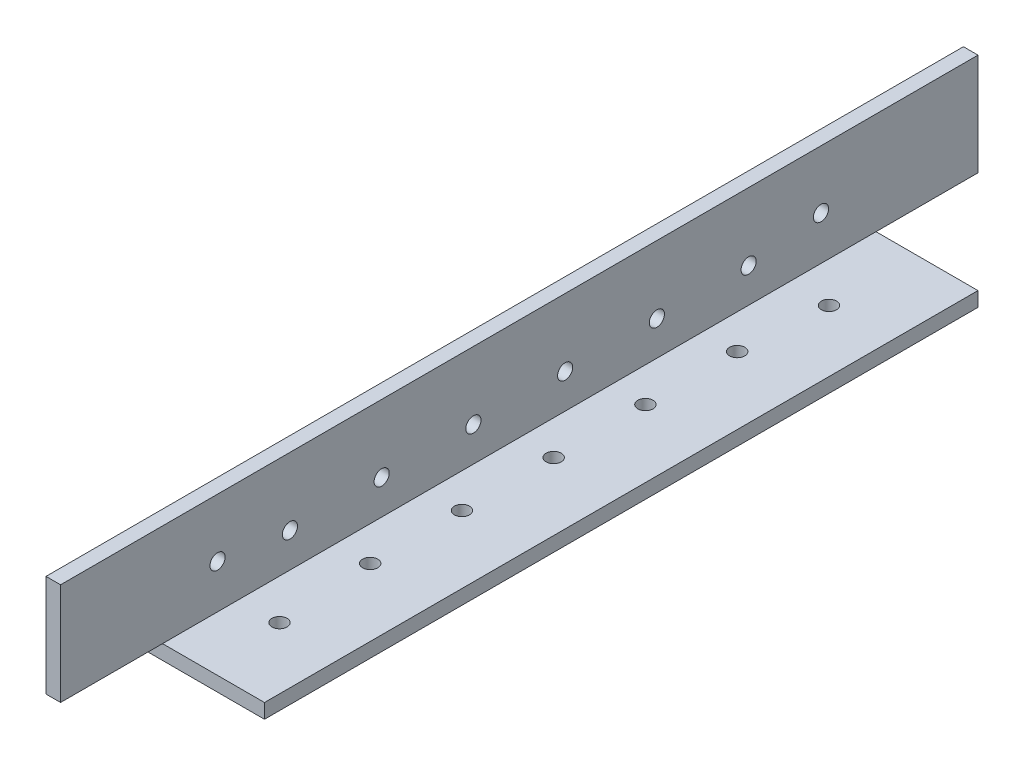
ISO-10303-21;
HEADER;
FILE_DESCRIPTION(('STEP AP214'),'2;1');
FILE_NAME('part.step','',(''),(''),'','','');
FILE_SCHEMA(('AUTOMOTIVE_DESIGN { 1 0 10303 214 1 1 1 1 }'));
ENDSEC;
DATA;
#1=APPLICATION_CONTEXT('core data for automotive mechanical design processes');
#2=APPLICATION_PROTOCOL_DEFINITION('international standard','automotive_design',2000,#1);
#3=PRODUCT_CONTEXT('',#1,'mechanical');
#4=PRODUCT('Part','Part','',(#3));
#5=PRODUCT_RELATED_PRODUCT_CATEGORY('part','',(#4));
#6=PRODUCT_DEFINITION_FORMATION('','',#4);
#7=PRODUCT_DEFINITION_CONTEXT('part definition',#1,'design');
#8=PRODUCT_DEFINITION('design','',#6,#7);
#9=PRODUCT_DEFINITION_SHAPE('','',#8);
#10=(LENGTH_UNIT() NAMED_UNIT(*) SI_UNIT(.MILLI.,.METRE.));
#11=(NAMED_UNIT(*) PLANE_ANGLE_UNIT() SI_UNIT($,.RADIAN.));
#12=(NAMED_UNIT(*) SI_UNIT($,.STERADIAN.) SOLID_ANGLE_UNIT());
#13=UNCERTAINTY_MEASURE_WITH_UNIT(LENGTH_MEASURE(1.E-05),#10,'distance_accuracy_value','');
#14=(GEOMETRIC_REPRESENTATION_CONTEXT(3) GLOBAL_UNCERTAINTY_ASSIGNED_CONTEXT((#13)) GLOBAL_UNIT_ASSIGNED_CONTEXT((#10,
#11,#12)) REPRESENTATION_CONTEXT('',''));
#15=CARTESIAN_POINT('',(0.,0.,0.));
#16=DIRECTION('',(0.,0.,1.));
#17=DIRECTION('',(1.,0.,0.));
#18=AXIS2_PLACEMENT_3D('',#15,#16,#17);
#19=CARTESIAN_POINT('',(0.,0.,1219.2));
#20=DIRECTION('',(0.,0.,1.));
#21=DIRECTION('',(1.,0.,0.));
#22=AXIS2_PLACEMENT_3D('',#19,#20,#21);
#23=PLANE('',#22);
#24=DIRECTION('',(1.,0.,0.));
#25=VECTOR('',#24,1.);
#26=CARTESIAN_POINT('',(25.4,3.175,1219.2));
#27=LINE('',#26,#25);
#28=CARTESIAN_POINT('',(0.,3.175,1219.2));
#29=VERTEX_POINT('',#28);
#30=CARTESIAN_POINT('',(3.175,3.175,1219.2));
#31=VERTEX_POINT('',#30);
#32=EDGE_CURVE('E228',#29,#31,#27,.T.);
#33=ORIENTED_EDGE('',*,*,#32,.T.);
#34=DIRECTION('',(0.,1.,0.));
#35=VECTOR('',#34,1.);
#36=CARTESIAN_POINT('',(3.175,3.175,1219.2));
#37=LINE('',#36,#35);
#38=CARTESIAN_POINT('',(3.175,25.4,1219.2));
#39=VERTEX_POINT('',#38);
#40=EDGE_CURVE('E59',#31,#39,#37,.T.);
#41=ORIENTED_EDGE('',*,*,#40,.T.);
#42=DIRECTION('',(-1.,0.,0.));
#43=VECTOR('',#42,1.);
#44=CARTESIAN_POINT('',(3.175,25.4,1219.2));
#45=LINE('',#44,#43);
#46=CARTESIAN_POINT('',(0.,25.4,1219.2));
#47=VERTEX_POINT('',#46);
#48=EDGE_CURVE('E254',#39,#47,#45,.T.);
#49=ORIENTED_EDGE('',*,*,#48,.T.);
#50=DIRECTION('',(0.,-1.,0.));
#51=VECTOR('',#50,1.);
#52=CARTESIAN_POINT('',(0.,25.4,1219.2));
#53=LINE('',#52,#51);
#54=EDGE_CURVE('E256',#47,#29,#53,.T.);
#55=ORIENTED_EDGE('',*,*,#54,.T.);
#56=EDGE_LOOP('',(#33,#41,#49,#55));
#57=FACE_BOUND('',#56,.T.);
#58=ADVANCED_FACE('F43',(#57),#23,.T.);
#59=CARTESIAN_POINT('',(60.,25.4,1019.2));
#60=DIRECTION('',(0.,0.,1.));
#61=DIRECTION('',(1.,0.,0.));
#62=AXIS2_PLACEMENT_3D('',#59,#60,#61);
#63=PLANE('',#62);
#64=DIRECTION('',(0.,1.,0.));
#65=VECTOR('',#64,1.);
#66=CARTESIAN_POINT('',(3.175,3.175,1019.2));
#67=LINE('',#66,#65);
#68=CARTESIAN_POINT('',(3.175,3.175,1019.2));
#69=VERTEX_POINT('',#68);
#70=CARTESIAN_POINT('',(3.17500000000002,25.4,1019.2));
#71=VERTEX_POINT('',#70);
#72=EDGE_CURVE('E117',#69,#71,#67,.T.);
#73=ORIENTED_EDGE('',*,*,#72,.F.);
#74=DIRECTION('',(1.,0.,0.));
#75=VECTOR('',#74,1.);
#76=CARTESIAN_POINT('',(60.,3.17500000000001,1019.2));
#77=LINE('',#76,#75);
#78=CARTESIAN_POINT('',(0.,3.175,1019.2));
#79=VERTEX_POINT('',#78);
#80=EDGE_CURVE('E52',#79,#69,#77,.T.);
#81=ORIENTED_EDGE('',*,*,#80,.F.);
#82=DIRECTION('',(0.,1.,0.));
#83=VECTOR('',#82,1.);
#84=CARTESIAN_POINT('',(0.,25.4,1019.2));
#85=LINE('',#84,#83);
#86=CARTESIAN_POINT('',(0.,25.4,1019.2));
#87=VERTEX_POINT('',#86);
#88=EDGE_CURVE('E250',#79,#87,#85,.T.);
#89=ORIENTED_EDGE('',*,*,#88,.T.);
#90=DIRECTION('',(-1.,0.,0.));
#91=VECTOR('',#90,1.);
#92=CARTESIAN_POINT('',(60.,25.4,1019.2));
#93=LINE('',#92,#91);
#94=EDGE_CURVE('E122',#71,#87,#93,.T.);
#95=ORIENTED_EDGE('',*,*,#94,.F.);
#96=EDGE_LOOP('',(#73,#81,#89,#95));
#97=FACE_BOUND('',#96,.T.);
#98=ADVANCED_FACE('F119',(#97),#63,.F.);
#99=CARTESIAN_POINT('',(3.175,3.175,1219.2));
#100=DIRECTION('',(-1.,0.,0.));
#101=DIRECTION('',(0.,-1.,0.));
#102=AXIS2_PLACEMENT_3D('',#99,#100,#101);
#103=PLANE('',#102);
#104=CARTESIAN_POINT('',(3.175,12.6999999999998,1053.42570433294));
#105=DIRECTION('',(1.,0.,0.));
#106=DIRECTION('',(0.,1.,0.));
#107=AXIS2_PLACEMENT_3D('',#104,#105,#106);
#108=CIRCLE('',#107,1.64999999999982);
#109=CARTESIAN_POINT('',(3.175,14.3499999999997,1053.42570433294));
#110=VERTEX_POINT('',#109);
#111=EDGE_CURVE('E159',#110,#110,#108,.T.);
#112=ORIENTED_EDGE('',*,*,#111,.F.);
#113=EDGE_LOOP('',(#112));
#114=FACE_BOUND('',#113,.T.);
#115=CARTESIAN_POINT('',(3.175,12.7000000000007,1184.97929566706));
#116=DIRECTION('',(1.,0.,0.));
#117=DIRECTION('',(0.,1.,0.));
#118=AXIS2_PLACEMENT_3D('',#115,#116,#117);
#119=CIRCLE('',#118,1.64999999999982);
#120=CARTESIAN_POINT('',(3.175,14.3500000000006,1184.97929566706));
#121=VERTEX_POINT('',#120);
#122=EDGE_CURVE('E165',#121,#121,#119,.T.);
#123=ORIENTED_EDGE('',*,*,#122,.F.);
#124=EDGE_LOOP('',(#123));
#125=FACE_BOUND('',#124,.T.);
#126=CARTESIAN_POINT('',(3.175,10.675,1169.2));
#127=DIRECTION('',(1.,0.,0.));
#128=DIRECTION('',(0.,1.,0.));
#129=AXIS2_PLACEMENT_3D('',#126,#127,#128);
#130=CIRCLE('',#129,1.64999999999982);
#131=CARTESIAN_POINT('',(3.175,12.3249999999998,1169.2));
#132=VERTEX_POINT('',#131);
#133=EDGE_CURVE('E144',#132,#132,#130,.T.);
#134=ORIENTED_EDGE('',*,*,#133,.F.);
#135=EDGE_LOOP('',(#134));
#136=FACE_BOUND('',#135,.T.);
#137=CARTESIAN_POINT('',(3.175,10.675,1149.2));
#138=DIRECTION('',(1.,0.,0.));
#139=DIRECTION('',(0.,1.,0.));
#140=AXIS2_PLACEMENT_3D('',#137,#138,#139);
#141=CIRCLE('',#140,1.64999999999982);
#142=CARTESIAN_POINT('',(3.175,12.3249999999998,1149.2));
#143=VERTEX_POINT('',#142);
#144=EDGE_CURVE('E207',#143,#143,#141,.T.);
#145=ORIENTED_EDGE('',*,*,#144,.F.);
#146=EDGE_LOOP('',(#145));
#147=FACE_BOUND('',#146,.T.);
#148=CARTESIAN_POINT('',(3.175,10.675,1129.2));
#149=DIRECTION('',(1.,0.,0.));
#150=DIRECTION('',(0.,1.,0.));
#151=AXIS2_PLACEMENT_3D('',#148,#149,#150);
#152=CIRCLE('',#151,1.64999999999982);
#153=CARTESIAN_POINT('',(3.175,12.3249999999998,1129.2));
#154=VERTEX_POINT('',#153);
#155=EDGE_CURVE('E210',#154,#154,#152,.T.);
#156=ORIENTED_EDGE('',*,*,#155,.F.);
#157=EDGE_LOOP('',(#156));
#158=FACE_BOUND('',#157,.T.);
#159=CARTESIAN_POINT('',(3.175,10.675,1109.2));
#160=DIRECTION('',(1.,0.,0.));
#161=DIRECTION('',(0.,1.,0.));
#162=AXIS2_PLACEMENT_3D('',#159,#160,#161);
#163=CIRCLE('',#162,1.64999999999982);
#164=CARTESIAN_POINT('',(3.175,12.3249999999998,1109.2));
#165=VERTEX_POINT('',#164);
#166=EDGE_CURVE('E213',#165,#165,#163,.T.);
#167=ORIENTED_EDGE('',*,*,#166,.F.);
#168=EDGE_LOOP('',(#167));
#169=FACE_BOUND('',#168,.T.);
#170=CARTESIAN_POINT('',(3.175,10.675,1089.2));
#171=DIRECTION('',(1.,0.,0.));
#172=DIRECTION('',(0.,1.,0.));
#173=AXIS2_PLACEMENT_3D('',#170,#171,#172);
#174=CIRCLE('',#173,1.64999999999982);
#175=CARTESIAN_POINT('',(3.175,12.3249999999998,1089.2));
#176=VERTEX_POINT('',#175);
#177=EDGE_CURVE('E216',#176,#176,#174,.T.);
#178=ORIENTED_EDGE('',*,*,#177,.F.);
#179=EDGE_LOOP('',(#178));
#180=FACE_BOUND('',#179,.T.);
#181=CARTESIAN_POINT('',(3.175,10.675,1069.2));
#182=DIRECTION('',(1.,0.,0.));
#183=DIRECTION('',(0.,1.,0.));
#184=AXIS2_PLACEMENT_3D('',#181,#182,#183);
#185=CIRCLE('',#184,1.64999999999982);
#186=CARTESIAN_POINT('',(3.175,12.3249999999998,1069.2));
#187=VERTEX_POINT('',#186);
#188=EDGE_CURVE('E204',#187,#187,#185,.T.);
#189=ORIENTED_EDGE('',*,*,#188,.F.);
#190=EDGE_LOOP('',(#189));
#191=FACE_BOUND('',#190,.T.);
#192=DIRECTION('',(0.,0.,-1.));
#193=VECTOR('',#192,1.);
#194=CARTESIAN_POINT('',(3.175,25.4,1219.2));
#195=LINE('',#194,#193);
#196=EDGE_CURVE('E134',#39,#71,#195,.T.);
#197=ORIENTED_EDGE('',*,*,#196,.F.);
#198=ORIENTED_EDGE('',*,*,#40,.F.);
#199=DIRECTION('',(0.,0.,-1.));
#200=VECTOR('',#199,1.);
#201=CARTESIAN_POINT('',(3.175,3.175,1219.2));
#202=LINE('',#201,#200);
#203=CARTESIAN_POINT('',(3.175,3.175,1196.97));
#204=VERTEX_POINT('',#203);
#205=EDGE_CURVE('E11',#31,#204,#202,.T.);
#206=ORIENTED_EDGE('',*,*,#205,.T.);
#207=DIRECTION('',(0.,0.,-1.));
#208=VECTOR('',#207,1.);
#209=CARTESIAN_POINT('',(3.175,3.175,1239.2));
#210=LINE('',#209,#208);
#211=CARTESIAN_POINT('',(3.175,3.175,1041.43));
#212=VERTEX_POINT('',#211);
#213=EDGE_CURVE('E129',#204,#212,#210,.T.);
#214=ORIENTED_EDGE('',*,*,#213,.T.);
#215=EDGE_CURVE('E127',#212,#69,#210,.T.);
#216=ORIENTED_EDGE('',*,*,#215,.T.);
#217=ORIENTED_EDGE('',*,*,#72,.T.);
#218=EDGE_LOOP('',(#197,#198,#206,#214,#216,#217));
#219=FACE_BOUND('',#218,.T.);
#220=ADVANCED_FACE('F45',(#114,#125,#136,#147,#158,#169,#180,#191,#219),#103,.F.);
#221=CARTESIAN_POINT('',(3.175,25.4,1219.2));
#222=DIRECTION('',(0.,-1.,0.));
#223=DIRECTION('',(1.,0.,0.));
#224=AXIS2_PLACEMENT_3D('',#221,#222,#223);
#225=PLANE('',#224);
#226=ORIENTED_EDGE('',*,*,#196,.T.);
#227=ORIENTED_EDGE('',*,*,#94,.T.);
#228=DIRECTION('',(0.,0.,-1.));
#229=VECTOR('',#228,1.);
#230=CARTESIAN_POINT('',(0.,25.4,1219.2));
#231=LINE('',#230,#229);
#232=EDGE_CURVE('E136',#47,#87,#231,.T.);
#233=ORIENTED_EDGE('',*,*,#232,.F.);
#234=ORIENTED_EDGE('',*,*,#48,.F.);
#235=EDGE_LOOP('',(#226,#227,#233,#234));
#236=FACE_BOUND('',#235,.T.);
#237=ADVANCED_FACE('F273',(#236),#225,.F.);
#238=CARTESIAN_POINT('',(0.,25.4,1219.2));
#239=DIRECTION('',(1.,0.,0.));
#240=DIRECTION('',(0.,1.,0.));
#241=AXIS2_PLACEMENT_3D('',#238,#239,#240);
#242=PLANE('',#241);
#243=CARTESIAN_POINT('',(0.,12.6999999999998,1053.42570433294));
#244=DIRECTION('',(1.,0.,0.));
#245=DIRECTION('',(0.,1.,0.));
#246=AXIS2_PLACEMENT_3D('',#243,#244,#245);
#247=CIRCLE('',#246,1.64999999999982);
#248=CARTESIAN_POINT('',(0.,14.3499999999997,1053.42570433294));
#249=VERTEX_POINT('',#248);
#250=EDGE_CURVE('E47',#249,#249,#247,.T.);
#251=ORIENTED_EDGE('',*,*,#250,.T.);
#252=EDGE_LOOP('',(#251));
#253=FACE_BOUND('',#252,.T.);
#254=CARTESIAN_POINT('',(0.,12.7000000000007,1184.97929566706));
#255=DIRECTION('',(1.,0.,0.));
#256=DIRECTION('',(0.,1.,0.));
#257=AXIS2_PLACEMENT_3D('',#254,#255,#256);
#258=CIRCLE('',#257,1.64999999999982);
#259=CARTESIAN_POINT('',(0.,14.3500000000006,1184.97929566706));
#260=VERTEX_POINT('',#259);
#261=EDGE_CURVE('E157',#260,#260,#258,.T.);
#262=ORIENTED_EDGE('',*,*,#261,.T.);
#263=EDGE_LOOP('',(#262));
#264=FACE_BOUND('',#263,.T.);
#265=CARTESIAN_POINT('',(0.,10.675,1169.2));
#266=DIRECTION('',(1.,0.,0.));
#267=DIRECTION('',(0.,1.,0.));
#268=AXIS2_PLACEMENT_3D('',#265,#266,#267);
#269=CIRCLE('',#268,1.64999999999982);
#270=CARTESIAN_POINT('',(0.,12.3249999999998,1169.2));
#271=VERTEX_POINT('',#270);
#272=EDGE_CURVE('E131',#271,#271,#269,.T.);
#273=ORIENTED_EDGE('',*,*,#272,.T.);
#274=EDGE_LOOP('',(#273));
#275=FACE_BOUND('',#274,.T.);
#276=CARTESIAN_POINT('',(0.,10.675,1149.2));
#277=DIRECTION('',(1.,0.,0.));
#278=DIRECTION('',(0.,1.,0.));
#279=AXIS2_PLACEMENT_3D('',#276,#277,#278);
#280=CIRCLE('',#279,1.64999999999982);
#281=CARTESIAN_POINT('',(0.,12.3249999999998,1149.2));
#282=VERTEX_POINT('',#281);
#283=EDGE_CURVE('E153',#282,#282,#280,.T.);
#284=ORIENTED_EDGE('',*,*,#283,.T.);
#285=EDGE_LOOP('',(#284));
#286=FACE_BOUND('',#285,.T.);
#287=CARTESIAN_POINT('',(0.,10.675,1129.2));
#288=DIRECTION('',(1.,0.,0.));
#289=DIRECTION('',(0.,1.,0.));
#290=AXIS2_PLACEMENT_3D('',#287,#288,#289);
#291=CIRCLE('',#290,1.64999999999982);
#292=CARTESIAN_POINT('',(0.,12.3249999999998,1129.2));
#293=VERTEX_POINT('',#292);
#294=EDGE_CURVE('E150',#293,#293,#291,.T.);
#295=ORIENTED_EDGE('',*,*,#294,.T.);
#296=EDGE_LOOP('',(#295));
#297=FACE_BOUND('',#296,.T.);
#298=CARTESIAN_POINT('',(0.,10.675,1109.2));
#299=DIRECTION('',(1.,0.,0.));
#300=DIRECTION('',(0.,1.,0.));
#301=AXIS2_PLACEMENT_3D('',#298,#299,#300);
#302=CIRCLE('',#301,1.64999999999982);
#303=CARTESIAN_POINT('',(0.,12.3249999999998,1109.2));
#304=VERTEX_POINT('',#303);
#305=EDGE_CURVE('E147',#304,#304,#302,.T.);
#306=ORIENTED_EDGE('',*,*,#305,.T.);
#307=EDGE_LOOP('',(#306));
#308=FACE_BOUND('',#307,.T.);
#309=CARTESIAN_POINT('',(0.,10.675,1089.2));
#310=DIRECTION('',(1.,0.,0.));
#311=DIRECTION('',(0.,1.,0.));
#312=AXIS2_PLACEMENT_3D('',#309,#310,#311);
#313=CIRCLE('',#312,1.64999999999982);
#314=CARTESIAN_POINT('',(0.,12.3249999999998,1089.2));
#315=VERTEX_POINT('',#314);
#316=EDGE_CURVE('E143',#315,#315,#313,.T.);
#317=ORIENTED_EDGE('',*,*,#316,.T.);
#318=EDGE_LOOP('',(#317));
#319=FACE_BOUND('',#318,.T.);
#320=CARTESIAN_POINT('',(0.,10.675,1069.2));
#321=DIRECTION('',(1.,0.,0.));
#322=DIRECTION('',(0.,1.,0.));
#323=AXIS2_PLACEMENT_3D('',#320,#321,#322);
#324=CIRCLE('',#323,1.64999999999982);
#325=CARTESIAN_POINT('',(0.,12.3249999999998,1069.2));
#326=VERTEX_POINT('',#325);
#327=EDGE_CURVE('E140',#326,#326,#324,.T.);
#328=ORIENTED_EDGE('',*,*,#327,.T.);
#329=EDGE_LOOP('',(#328));
#330=FACE_BOUND('',#329,.T.);
#331=DIRECTION('',(0.,0.,-1.));
#332=VECTOR('',#331,1.);
#333=CARTESIAN_POINT('',(0.,0.,1219.2));
#334=LINE('',#333,#332);
#335=CARTESIAN_POINT('',(0.,0.,1196.97));
#336=VERTEX_POINT('',#335);
#337=CARTESIAN_POINT('',(0.,0.,1041.43));
#338=VERTEX_POINT('',#337);
#339=EDGE_CURVE('E264',#336,#338,#334,.T.);
#340=ORIENTED_EDGE('',*,*,#339,.F.);
#341=DIRECTION('',(0.,-1.,0.));
#342=VECTOR('',#341,1.);
#343=CARTESIAN_POINT('',(0.,36.9290056882142,1196.97));
#344=LINE('',#343,#342);
#345=CARTESIAN_POINT('',(0.,3.175,1196.97));
#346=VERTEX_POINT('',#345);
#347=EDGE_CURVE('E231',#346,#336,#344,.T.);
#348=ORIENTED_EDGE('',*,*,#347,.F.);
#349=DIRECTION('',(0.,0.,1.));
#350=VECTOR('',#349,1.);
#351=CARTESIAN_POINT('',(0.,3.175,1219.2));
#352=LINE('',#351,#350);
#353=EDGE_CURVE('E221',#346,#29,#352,.T.);
#354=ORIENTED_EDGE('',*,*,#353,.T.);
#355=ORIENTED_EDGE('',*,*,#54,.F.);
#356=ORIENTED_EDGE('',*,*,#232,.T.);
#357=ORIENTED_EDGE('',*,*,#88,.F.);
#358=DIRECTION('',(0.,0.,1.));
#359=VECTOR('',#358,1.);
#360=CARTESIAN_POINT('',(0.,3.175,1019.2));
#361=LINE('',#360,#359);
#362=CARTESIAN_POINT('',(0.,3.175,1041.43));
#363=VERTEX_POINT('',#362);
#364=EDGE_CURVE('E67',#79,#363,#361,.T.);
#365=ORIENTED_EDGE('',*,*,#364,.T.);
#366=DIRECTION('',(0.,-1.,0.));
#367=VECTOR('',#366,1.);
#368=CARTESIAN_POINT('',(0.,36.9290056882142,1041.43));
#369=LINE('',#368,#367);
#370=EDGE_CURVE('E240',#363,#338,#369,.T.);
#371=ORIENTED_EDGE('',*,*,#370,.T.);
#372=EDGE_LOOP('',(#340,#348,#354,#355,#356,#357,#365,#371));
#373=FACE_BOUND('',#372,.T.);
#374=ADVANCED_FACE('F270',(#253,#264,#275,#286,#297,#308,#319,#330,#373),#242,.F.);
#375=CARTESIAN_POINT('',(0.,0.,1219.2));
#376=DIRECTION('',(0.,1.,0.));
#377=DIRECTION('',(0.,0.,1.));
#378=AXIS2_PLACEMENT_3D('',#375,#376,#377);
#379=PLANE('',#378);
#380=CARTESIAN_POINT('',(11.9634000000024,0.,1180.26062285682));
#381=DIRECTION('',(0.,1.,0.));
#382=DIRECTION('',(0.,0.,1.));
#383=AXIS2_PLACEMENT_3D('',#380,#381,#382);
#384=CIRCLE('',#383,1.65000000000001);
#385=CARTESIAN_POINT('',(11.9634000000024,0.,1181.91062285682));
#386=VERTEX_POINT('',#385);
#387=EDGE_CURVE('E170',#386,#386,#384,.T.);
#388=ORIENTED_EDGE('',*,*,#387,.T.);
#389=EDGE_LOOP('',(#388));
#390=FACE_BOUND('',#389,.T.);
#391=CARTESIAN_POINT('',(11.9634000000002,0.,1060.48));
#392=DIRECTION('',(0.,1.,0.));
#393=DIRECTION('',(0.,0.,1.));
#394=AXIS2_PLACEMENT_3D('',#391,#392,#393);
#395=CIRCLE('',#394,1.65);
#396=CARTESIAN_POINT('',(11.9634000000002,0.,1062.13));
#397=VERTEX_POINT('',#396);
#398=EDGE_CURVE('E387',#397,#397,#395,.T.);
#399=ORIENTED_EDGE('',*,*,#398,.T.);
#400=EDGE_LOOP('',(#399));
#401=FACE_BOUND('',#400,.T.);
#402=CARTESIAN_POINT('',(10.675,0.,1079.2));
#403=DIRECTION('',(0.,1.,0.));
#404=DIRECTION('',(0.,0.,1.));
#405=AXIS2_PLACEMENT_3D('',#402,#403,#404);
#406=CIRCLE('',#405,1.65000000000001);
#407=CARTESIAN_POINT('',(10.675,0.,1080.85));
#408=VERTEX_POINT('',#407);
#409=EDGE_CURVE('E201',#408,#408,#406,.T.);
#410=ORIENTED_EDGE('',*,*,#409,.T.);
#411=EDGE_LOOP('',(#410));
#412=FACE_BOUND('',#411,.T.);
#413=CARTESIAN_POINT('',(10.6750000000002,0.,1099.2));
#414=DIRECTION('',(0.,1.,0.));
#415=DIRECTION('',(0.,0.,1.));
#416=AXIS2_PLACEMENT_3D('',#413,#414,#415);
#417=CIRCLE('',#416,1.65000000000001);
#418=CARTESIAN_POINT('',(10.6750000000002,0.,1100.85));
#419=VERTEX_POINT('',#418);
#420=EDGE_CURVE('E198',#419,#419,#417,.T.);
#421=ORIENTED_EDGE('',*,*,#420,.T.);
#422=EDGE_LOOP('',(#421));
#423=FACE_BOUND('',#422,.T.);
#424=CARTESIAN_POINT('',(10.6750000000004,0.,1119.2));
#425=DIRECTION('',(0.,1.,0.));
#426=DIRECTION('',(0.,0.,1.));
#427=AXIS2_PLACEMENT_3D('',#424,#425,#426);
#428=CIRCLE('',#427,1.65000000000001);
#429=CARTESIAN_POINT('',(10.6750000000004,0.,1120.85));
#430=VERTEX_POINT('',#429);
#431=EDGE_CURVE('E195',#430,#430,#428,.T.);
#432=ORIENTED_EDGE('',*,*,#431,.T.);
#433=EDGE_LOOP('',(#432));
#434=FACE_BOUND('',#433,.T.);
#435=CARTESIAN_POINT('',(10.6750000000006,0.,1139.2));
#436=DIRECTION('',(0.,1.,0.));
#437=DIRECTION('',(0.,0.,1.));
#438=AXIS2_PLACEMENT_3D('',#435,#436,#437);
#439=CIRCLE('',#438,1.65000000000001);
#440=CARTESIAN_POINT('',(10.6750000000006,0.,1140.85));
#441=VERTEX_POINT('',#440);
#442=EDGE_CURVE('E192',#441,#441,#439,.T.);
#443=ORIENTED_EDGE('',*,*,#442,.T.);
#444=EDGE_LOOP('',(#443));
#445=FACE_BOUND('',#444,.T.);
#446=CARTESIAN_POINT('',(10.6750000000008,0.,1159.2));
#447=DIRECTION('',(0.,1.,0.));
#448=DIRECTION('',(0.,0.,1.));
#449=AXIS2_PLACEMENT_3D('',#446,#447,#448);
#450=CIRCLE('',#449,1.65000000000001);
#451=CARTESIAN_POINT('',(10.6750000000008,0.,1160.85));
#452=VERTEX_POINT('',#451);
#453=EDGE_CURVE('E178',#452,#452,#450,.T.);
#454=ORIENTED_EDGE('',*,*,#453,.T.);
#455=EDGE_LOOP('',(#454));
#456=FACE_BOUND('',#455,.T.);
#457=DIRECTION('',(0.,0.,-1.));
#458=VECTOR('',#457,1.);
#459=CARTESIAN_POINT('',(25.4,0.,1219.2));
#460=LINE('',#459,#458);
#461=CARTESIAN_POINT('',(25.4,0.,1196.97));
#462=VERTEX_POINT('',#461);
#463=CARTESIAN_POINT('',(25.4,0.,1041.43));
#464=VERTEX_POINT('',#463);
#465=EDGE_CURVE('E262',#462,#464,#460,.T.);
#466=ORIENTED_EDGE('',*,*,#465,.F.);
#467=DIRECTION('',(1.,0.,0.));
#468=VECTOR('',#467,1.);
#469=CARTESIAN_POINT('',(25.4,0.,1196.97));
#470=LINE('',#469,#468);
#471=EDGE_CURVE('E229',#336,#462,#470,.T.);
#472=ORIENTED_EDGE('',*,*,#471,.F.);
#473=ORIENTED_EDGE('',*,*,#339,.T.);
#474=DIRECTION('',(-1.,0.,0.));
#475=VECTOR('',#474,1.);
#476=CARTESIAN_POINT('',(25.4,0.,1041.43));
#477=LINE('',#476,#475);
#478=EDGE_CURVE('E237',#464,#338,#477,.T.);
#479=ORIENTED_EDGE('',*,*,#478,.F.);
#480=EDGE_LOOP('',(#466,#472,#473,#479));
#481=FACE_BOUND('',#480,.T.);
#482=ADVANCED_FACE('F285',(#390,#401,#412,#423,#434,#445,#456,#481),#379,.F.);
#483=CARTESIAN_POINT('',(25.4,0.,1219.2));
#484=DIRECTION('',(-1.,0.,0.));
#485=DIRECTION('',(0.,0.,1.));
#486=AXIS2_PLACEMENT_3D('',#483,#484,#485);
#487=PLANE('',#486);
#488=DIRECTION('',(0.,0.,-1.));
#489=VECTOR('',#488,1.);
#490=CARTESIAN_POINT('',(25.4,3.175,1219.2));
#491=LINE('',#490,#489);
#492=CARTESIAN_POINT('',(25.4,3.175,1196.97));
#493=VERTEX_POINT('',#492);
#494=CARTESIAN_POINT('',(25.4,3.175,1041.43));
#495=VERTEX_POINT('',#494);
#496=EDGE_CURVE('E259',#493,#495,#491,.T.);
#497=ORIENTED_EDGE('',*,*,#496,.F.);
#498=DIRECTION('',(0.,-1.,0.));
#499=VECTOR('',#498,1.);
#500=CARTESIAN_POINT('',(25.4,36.9290056882142,1196.97));
#501=LINE('',#500,#499);
#502=EDGE_CURVE('E225',#493,#462,#501,.T.);
#503=ORIENTED_EDGE('',*,*,#502,.T.);
#504=ORIENTED_EDGE('',*,*,#465,.T.);
#505=DIRECTION('',(0.,-1.,0.));
#506=VECTOR('',#505,1.);
#507=CARTESIAN_POINT('',(25.4,36.9290056882142,1041.43));
#508=LINE('',#507,#506);
#509=EDGE_CURVE('E243',#495,#464,#508,.T.);
#510=ORIENTED_EDGE('',*,*,#509,.F.);
#511=EDGE_LOOP('',(#497,#503,#504,#510));
#512=FACE_BOUND('',#511,.T.);
#513=ADVANCED_FACE('F290',(#512),#487,.F.);
#514=CARTESIAN_POINT('',(25.4,3.175,1219.2));
#515=DIRECTION('',(0.,-1.,0.));
#516=DIRECTION('',(1.,0.,0.));
#517=AXIS2_PLACEMENT_3D('',#514,#515,#516);
#518=PLANE('',#517);
#519=CARTESIAN_POINT('',(11.9634000000024,3.175,1180.26062285682));
#520=DIRECTION('',(0.,1.,0.));
#521=DIRECTION('',(-1.,0.,0.));
#522=AXIS2_PLACEMENT_3D('',#519,#520,#521);
#523=CIRCLE('',#522,1.65000000000001);
#524=CARTESIAN_POINT('',(10.3134000000024,3.175,1180.26062285682));
#525=VERTEX_POINT('',#524);
#526=EDGE_CURVE('E383',#525,#525,#523,.T.);
#527=ORIENTED_EDGE('',*,*,#526,.F.);
#528=EDGE_LOOP('',(#527));
#529=FACE_BOUND('',#528,.T.);
#530=CARTESIAN_POINT('',(11.9634000000002,3.175,1060.48));
#531=DIRECTION('',(0.,1.,0.));
#532=DIRECTION('',(-1.,0.,0.));
#533=AXIS2_PLACEMENT_3D('',#530,#531,#532);
#534=CIRCLE('',#533,1.65);
#535=CARTESIAN_POINT('',(10.3134000000002,3.175,1060.48));
#536=VERTEX_POINT('',#535);
#537=EDGE_CURVE('E391',#536,#536,#534,.T.);
#538=ORIENTED_EDGE('',*,*,#537,.F.);
#539=EDGE_LOOP('',(#538));
#540=FACE_BOUND('',#539,.T.);
#541=CARTESIAN_POINT('',(10.675,3.175,1079.2));
#542=DIRECTION('',(0.,1.,0.));
#543=DIRECTION('',(-1.,0.,0.));
#544=AXIS2_PLACEMENT_3D('',#541,#542,#543);
#545=CIRCLE('',#544,1.65000000000001);
#546=CARTESIAN_POINT('',(9.02499999999999,3.175,1079.2));
#547=VERTEX_POINT('',#546);
#548=EDGE_CURVE('E175',#547,#547,#545,.T.);
#549=ORIENTED_EDGE('',*,*,#548,.F.);
#550=EDGE_LOOP('',(#549));
#551=FACE_BOUND('',#550,.T.);
#552=CARTESIAN_POINT('',(10.6750000000002,3.175,1099.2));
#553=DIRECTION('',(0.,1.,0.));
#554=DIRECTION('',(-1.,0.,0.));
#555=AXIS2_PLACEMENT_3D('',#552,#553,#554);
#556=CIRCLE('',#555,1.65000000000001);
#557=CARTESIAN_POINT('',(9.0250000000002,3.175,1099.2));
#558=VERTEX_POINT('',#557);
#559=EDGE_CURVE('E179',#558,#558,#556,.T.);
#560=ORIENTED_EDGE('',*,*,#559,.F.);
#561=EDGE_LOOP('',(#560));
#562=FACE_BOUND('',#561,.T.);
#563=CARTESIAN_POINT('',(10.6750000000004,3.175,1119.2));
#564=DIRECTION('',(0.,1.,0.));
#565=DIRECTION('',(-1.,0.,0.));
#566=AXIS2_PLACEMENT_3D('',#563,#564,#565);
#567=CIRCLE('',#566,1.65000000000001);
#568=CARTESIAN_POINT('',(9.02500000000041,3.175,1119.2));
#569=VERTEX_POINT('',#568);
#570=EDGE_CURVE('E182',#569,#569,#567,.T.);
#571=ORIENTED_EDGE('',*,*,#570,.F.);
#572=EDGE_LOOP('',(#571));
#573=FACE_BOUND('',#572,.T.);
#574=CARTESIAN_POINT('',(10.6750000000006,3.175,1139.2));
#575=DIRECTION('',(0.,1.,0.));
#576=DIRECTION('',(-1.,0.,0.));
#577=AXIS2_PLACEMENT_3D('',#574,#575,#576);
#578=CIRCLE('',#577,1.65000000000001);
#579=CARTESIAN_POINT('',(9.02500000000062,3.175,1139.2));
#580=VERTEX_POINT('',#579);
#581=EDGE_CURVE('E185',#580,#580,#578,.T.);
#582=ORIENTED_EDGE('',*,*,#581,.F.);
#583=EDGE_LOOP('',(#582));
#584=FACE_BOUND('',#583,.T.);
#585=CARTESIAN_POINT('',(10.6750000000008,3.175,1159.2));
#586=DIRECTION('',(0.,1.,0.));
#587=DIRECTION('',(-1.,0.,0.));
#588=AXIS2_PLACEMENT_3D('',#585,#586,#587);
#589=CIRCLE('',#588,1.65000000000001);
#590=CARTESIAN_POINT('',(9.02500000000083,3.175,1159.2));
#591=VERTEX_POINT('',#590);
#592=EDGE_CURVE('E163',#591,#591,#589,.T.);
#593=ORIENTED_EDGE('',*,*,#592,.F.);
#594=EDGE_LOOP('',(#593));
#595=FACE_BOUND('',#594,.T.);
#596=ORIENTED_EDGE('',*,*,#496,.T.);
#597=DIRECTION('',(1.,0.,0.));
#598=VECTOR('',#597,1.);
#599=CARTESIAN_POINT('',(25.4,3.175,1041.43));
#600=LINE('',#599,#598);
#601=EDGE_CURVE('E239',#212,#495,#600,.T.);
#602=ORIENTED_EDGE('',*,*,#601,.F.);
#603=ORIENTED_EDGE('',*,*,#213,.F.);
#604=DIRECTION('',(-1.,0.,0.));
#605=VECTOR('',#604,1.);
#606=CARTESIAN_POINT('',(25.4,3.175,1196.97));
#607=LINE('',#606,#605);
#608=EDGE_CURVE('E226',#493,#204,#607,.T.);
#609=ORIENTED_EDGE('',*,*,#608,.F.);
#610=EDGE_LOOP('',(#596,#602,#603,#609));
#611=FACE_BOUND('',#610,.T.);
#612=ADVANCED_FACE('F295',(#529,#540,#551,#562,#573,#584,#595,#611),#518,.F.);
#613=CARTESIAN_POINT('',(25.4,36.9290056882142,1041.43));
#614=DIRECTION('',(0.,0.,1.));
#615=DIRECTION('',(1.,0.,0.));
#616=AXIS2_PLACEMENT_3D('',#613,#614,#615);
#617=PLANE('',#616);
#618=EDGE_CURVE('E248',#363,#212,#600,.T.);
#619=ORIENTED_EDGE('',*,*,#618,.T.);
#620=ORIENTED_EDGE('',*,*,#601,.T.);
#621=ORIENTED_EDGE('',*,*,#509,.T.);
#622=ORIENTED_EDGE('',*,*,#478,.T.);
#623=ORIENTED_EDGE('',*,*,#370,.F.);
#624=EDGE_LOOP('',(#619,#620,#621,#622,#623));
#625=FACE_BOUND('',#624,.T.);
#626=ADVANCED_FACE('F292',(#625),#617,.F.);
#627=CARTESIAN_POINT('',(25.4,3.175,1219.2));
#628=DIRECTION('',(0.,-1.,0.));
#629=DIRECTION('',(1.,0.,0.));
#630=AXIS2_PLACEMENT_3D('',#627,#628,#629);
#631=PLANE('',#630);
#632=ORIENTED_EDGE('',*,*,#215,.F.);
#633=ORIENTED_EDGE('',*,*,#618,.F.);
#634=ORIENTED_EDGE('',*,*,#364,.F.);
#635=ORIENTED_EDGE('',*,*,#80,.T.);
#636=EDGE_LOOP('',(#632,#633,#634,#635));
#637=FACE_BOUND('',#636,.T.);
#638=ADVANCED_FACE('F133',(#637),#631,.T.);
#639=CARTESIAN_POINT('',(25.4,36.9290056882142,1196.97));
#640=DIRECTION('',(0.,0.,-1.));
#641=DIRECTION('',(-1.,0.,0.));
#642=AXIS2_PLACEMENT_3D('',#639,#640,#641);
#643=PLANE('',#642);
#644=ORIENTED_EDGE('',*,*,#608,.T.);
#645=EDGE_CURVE('E224',#204,#346,#607,.T.);
#646=ORIENTED_EDGE('',*,*,#645,.T.);
#647=ORIENTED_EDGE('',*,*,#347,.T.);
#648=ORIENTED_EDGE('',*,*,#471,.T.);
#649=ORIENTED_EDGE('',*,*,#502,.F.);
#650=EDGE_LOOP('',(#644,#646,#647,#648,#649));
#651=FACE_BOUND('',#650,.T.);
#652=ADVANCED_FACE('F282',(#651),#643,.F.);
#653=CARTESIAN_POINT('',(25.4,3.175,1219.2));
#654=DIRECTION('',(0.,-1.,0.));
#655=DIRECTION('',(1.,0.,0.));
#656=AXIS2_PLACEMENT_3D('',#653,#654,#655);
#657=PLANE('',#656);
#658=ORIENTED_EDGE('',*,*,#205,.F.);
#659=ORIENTED_EDGE('',*,*,#32,.F.);
#660=ORIENTED_EDGE('',*,*,#353,.F.);
#661=ORIENTED_EDGE('',*,*,#645,.F.);
#662=EDGE_LOOP('',(#658,#659,#660,#661));
#663=FACE_BOUND('',#662,.T.);
#664=ADVANCED_FACE('F277',(#663),#657,.T.);
#665=CARTESIAN_POINT('',(-16.825,10.675,1069.2));
#666=DIRECTION('',(1.,0.,0.));
#667=DIRECTION('',(0.,1.,0.));
#668=AXIS2_PLACEMENT_3D('',#665,#666,#667);
#669=CYLINDRICAL_SURFACE('',#668,1.64999999999982);
#670=ORIENTED_EDGE('',*,*,#188,.T.);
#671=EDGE_LOOP('',(#670));
#672=FACE_BOUND('',#671,.T.);
#673=ORIENTED_EDGE('',*,*,#327,.F.);
#674=EDGE_LOOP('',(#673));
#675=FACE_BOUND('',#674,.T.);
#676=ADVANCED_FACE('F322',(#672,#675),#669,.F.);
#677=CARTESIAN_POINT('',(-16.825,10.675,1089.2));
#678=DIRECTION('',(1.,0.,0.));
#679=DIRECTION('',(0.,1.,0.));
#680=AXIS2_PLACEMENT_3D('',#677,#678,#679);
#681=CYLINDRICAL_SURFACE('',#680,1.64999999999982);
#682=ORIENTED_EDGE('',*,*,#177,.T.);
#683=EDGE_LOOP('',(#682));
#684=FACE_BOUND('',#683,.T.);
#685=ORIENTED_EDGE('',*,*,#316,.F.);
#686=EDGE_LOOP('',(#685));
#687=FACE_BOUND('',#686,.T.);
#688=ADVANCED_FACE('F325',(#684,#687),#681,.F.);
#689=CARTESIAN_POINT('',(-16.825,10.675,1109.2));
#690=DIRECTION('',(1.,0.,0.));
#691=DIRECTION('',(0.,1.,0.));
#692=AXIS2_PLACEMENT_3D('',#689,#690,#691);
#693=CYLINDRICAL_SURFACE('',#692,1.64999999999982);
#694=ORIENTED_EDGE('',*,*,#166,.T.);
#695=EDGE_LOOP('',(#694));
#696=FACE_BOUND('',#695,.T.);
#697=ORIENTED_EDGE('',*,*,#305,.F.);
#698=EDGE_LOOP('',(#697));
#699=FACE_BOUND('',#698,.T.);
#700=ADVANCED_FACE('F329',(#696,#699),#693,.F.);
#701=CARTESIAN_POINT('',(-16.825,10.675,1129.2));
#702=DIRECTION('',(1.,0.,0.));
#703=DIRECTION('',(0.,1.,0.));
#704=AXIS2_PLACEMENT_3D('',#701,#702,#703);
#705=CYLINDRICAL_SURFACE('',#704,1.64999999999982);
#706=ORIENTED_EDGE('',*,*,#155,.T.);
#707=EDGE_LOOP('',(#706));
#708=FACE_BOUND('',#707,.T.);
#709=ORIENTED_EDGE('',*,*,#294,.F.);
#710=EDGE_LOOP('',(#709));
#711=FACE_BOUND('',#710,.T.);
#712=ADVANCED_FACE('F333',(#708,#711),#705,.F.);
#713=CARTESIAN_POINT('',(-16.825,10.675,1149.2));
#714=DIRECTION('',(1.,0.,0.));
#715=DIRECTION('',(0.,1.,0.));
#716=AXIS2_PLACEMENT_3D('',#713,#714,#715);
#717=CYLINDRICAL_SURFACE('',#716,1.64999999999982);
#718=ORIENTED_EDGE('',*,*,#144,.T.);
#719=EDGE_LOOP('',(#718));
#720=FACE_BOUND('',#719,.T.);
#721=ORIENTED_EDGE('',*,*,#283,.F.);
#722=EDGE_LOOP('',(#721));
#723=FACE_BOUND('',#722,.T.);
#724=ADVANCED_FACE('F337',(#720,#723),#717,.F.);
#725=CARTESIAN_POINT('',(-16.825,10.675,1169.2));
#726=DIRECTION('',(1.,0.,0.));
#727=DIRECTION('',(0.,1.,0.));
#728=AXIS2_PLACEMENT_3D('',#725,#726,#727);
#729=CYLINDRICAL_SURFACE('',#728,1.64999999999982);
#730=ORIENTED_EDGE('',*,*,#133,.T.);
#731=EDGE_LOOP('',(#730));
#732=FACE_BOUND('',#731,.T.);
#733=ORIENTED_EDGE('',*,*,#272,.F.);
#734=EDGE_LOOP('',(#733));
#735=FACE_BOUND('',#734,.T.);
#736=ADVANCED_FACE('F341',(#732,#735),#729,.F.);
#737=CARTESIAN_POINT('',(10.6750000000008,-16.825,1159.2));
#738=DIRECTION('',(0.,1.,0.));
#739=DIRECTION('',(-1.,0.,0.));
#740=AXIS2_PLACEMENT_3D('',#737,#738,#739);
#741=CYLINDRICAL_SURFACE('',#740,1.65000000000001);
#742=ORIENTED_EDGE('',*,*,#592,.T.);
#743=EDGE_LOOP('',(#742));
#744=FACE_BOUND('',#743,.T.);
#745=ORIENTED_EDGE('',*,*,#453,.F.);
#746=EDGE_LOOP('',(#745));
#747=FACE_BOUND('',#746,.T.);
#748=ADVANCED_FACE('F345',(#744,#747),#741,.F.);
#749=CARTESIAN_POINT('',(10.6750000000006,-16.825,1139.2));
#750=DIRECTION('',(0.,1.,0.));
#751=DIRECTION('',(-1.,0.,0.));
#752=AXIS2_PLACEMENT_3D('',#749,#750,#751);
#753=CYLINDRICAL_SURFACE('',#752,1.65000000000001);
#754=ORIENTED_EDGE('',*,*,#581,.T.);
#755=EDGE_LOOP('',(#754));
#756=FACE_BOUND('',#755,.T.);
#757=ORIENTED_EDGE('',*,*,#442,.F.);
#758=EDGE_LOOP('',(#757));
#759=FACE_BOUND('',#758,.T.);
#760=ADVANCED_FACE('F349',(#756,#759),#753,.F.);
#761=CARTESIAN_POINT('',(10.6750000000004,-16.825,1119.2));
#762=DIRECTION('',(0.,1.,0.));
#763=DIRECTION('',(-1.,0.,0.));
#764=AXIS2_PLACEMENT_3D('',#761,#762,#763);
#765=CYLINDRICAL_SURFACE('',#764,1.65000000000001);
#766=ORIENTED_EDGE('',*,*,#570,.T.);
#767=EDGE_LOOP('',(#766));
#768=FACE_BOUND('',#767,.T.);
#769=ORIENTED_EDGE('',*,*,#431,.F.);
#770=EDGE_LOOP('',(#769));
#771=FACE_BOUND('',#770,.T.);
#772=ADVANCED_FACE('F353',(#768,#771),#765,.F.);
#773=CARTESIAN_POINT('',(10.6750000000002,-16.825,1099.2));
#774=DIRECTION('',(0.,1.,0.));
#775=DIRECTION('',(-1.,0.,0.));
#776=AXIS2_PLACEMENT_3D('',#773,#774,#775);
#777=CYLINDRICAL_SURFACE('',#776,1.65000000000001);
#778=ORIENTED_EDGE('',*,*,#559,.T.);
#779=EDGE_LOOP('',(#778));
#780=FACE_BOUND('',#779,.T.);
#781=ORIENTED_EDGE('',*,*,#420,.F.);
#782=EDGE_LOOP('',(#781));
#783=FACE_BOUND('',#782,.T.);
#784=ADVANCED_FACE('F357',(#780,#783),#777,.F.);
#785=CARTESIAN_POINT('',(10.675,-16.825,1079.2));
#786=DIRECTION('',(0.,1.,0.));
#787=DIRECTION('',(-1.,0.,0.));
#788=AXIS2_PLACEMENT_3D('',#785,#786,#787);
#789=CYLINDRICAL_SURFACE('',#788,1.65000000000001);
#790=ORIENTED_EDGE('',*,*,#548,.T.);
#791=EDGE_LOOP('',(#790));
#792=FACE_BOUND('',#791,.T.);
#793=ORIENTED_EDGE('',*,*,#409,.F.);
#794=EDGE_LOOP('',(#793));
#795=FACE_BOUND('',#794,.T.);
#796=ADVANCED_FACE('F361',(#792,#795),#789,.F.);
#797=CARTESIAN_POINT('',(-66.825,12.7000000000007,1184.97929566706));
#798=DIRECTION('',(1.,0.,0.));
#799=DIRECTION('',(0.,1.,0.));
#800=AXIS2_PLACEMENT_3D('',#797,#798,#799);
#801=CYLINDRICAL_SURFACE('',#800,1.64999999999982);
#802=ORIENTED_EDGE('',*,*,#122,.T.);
#803=EDGE_LOOP('',(#802));
#804=FACE_BOUND('',#803,.T.);
#805=ORIENTED_EDGE('',*,*,#261,.F.);
#806=EDGE_LOOP('',(#805));
#807=FACE_BOUND('',#806,.T.);
#808=ADVANCED_FACE('F365',(#804,#807),#801,.F.);
#809=CARTESIAN_POINT('',(-66.825,12.6999999999998,1053.42570433294));
#810=DIRECTION('',(1.,0.,0.));
#811=DIRECTION('',(0.,1.,0.));
#812=AXIS2_PLACEMENT_3D('',#809,#810,#811);
#813=CYLINDRICAL_SURFACE('',#812,1.64999999999982);
#814=ORIENTED_EDGE('',*,*,#111,.T.);
#815=EDGE_LOOP('',(#814));
#816=FACE_BOUND('',#815,.T.);
#817=ORIENTED_EDGE('',*,*,#250,.F.);
#818=EDGE_LOOP('',(#817));
#819=FACE_BOUND('',#818,.T.);
#820=ADVANCED_FACE('F369',(#816,#819),#813,.F.);
#821=CARTESIAN_POINT('',(11.9634000000002,-66.825,1060.48));
#822=DIRECTION('',(0.,1.,0.));
#823=DIRECTION('',(-1.,0.,0.));
#824=AXIS2_PLACEMENT_3D('',#821,#822,#823);
#825=CYLINDRICAL_SURFACE('',#824,1.65);
#826=ORIENTED_EDGE('',*,*,#537,.T.);
#827=EDGE_LOOP('',(#826));
#828=FACE_BOUND('',#827,.T.);
#829=ORIENTED_EDGE('',*,*,#398,.F.);
#830=EDGE_LOOP('',(#829));
#831=FACE_BOUND('',#830,.T.);
#832=ADVANCED_FACE('F373',(#828,#831),#825,.F.);
#833=CARTESIAN_POINT('',(11.9634000000024,-66.825,1180.26062285682));
#834=DIRECTION('',(0.,1.,0.));
#835=DIRECTION('',(-1.,0.,0.));
#836=AXIS2_PLACEMENT_3D('',#833,#834,#835);
#837=CYLINDRICAL_SURFACE('',#836,1.65000000000001);
#838=ORIENTED_EDGE('',*,*,#526,.T.);
#839=EDGE_LOOP('',(#838));
#840=FACE_BOUND('',#839,.T.);
#841=ORIENTED_EDGE('',*,*,#387,.F.);
#842=EDGE_LOOP('',(#841));
#843=FACE_BOUND('',#842,.T.);
#844=ADVANCED_FACE('F375',(#840,#843),#837,.F.);
#845=CLOSED_SHELL('',(#58,#98,#220,#237,#374,#482,#513,#612,#626,#638,#652,#664,#676,#688,#700,
#712,#724,#736,#748,#760,#772,#784,#796,#808,#820,#832,#844));
#846=MANIFOLD_SOLID_BREP('B2',#845);
#847=ADVANCED_BREP_SHAPE_REPRESENTATION('',(#18,#846),#14);
#848=SHAPE_DEFINITION_REPRESENTATION(#9,#847);
ENDSEC;
END-ISO-10303-21;
